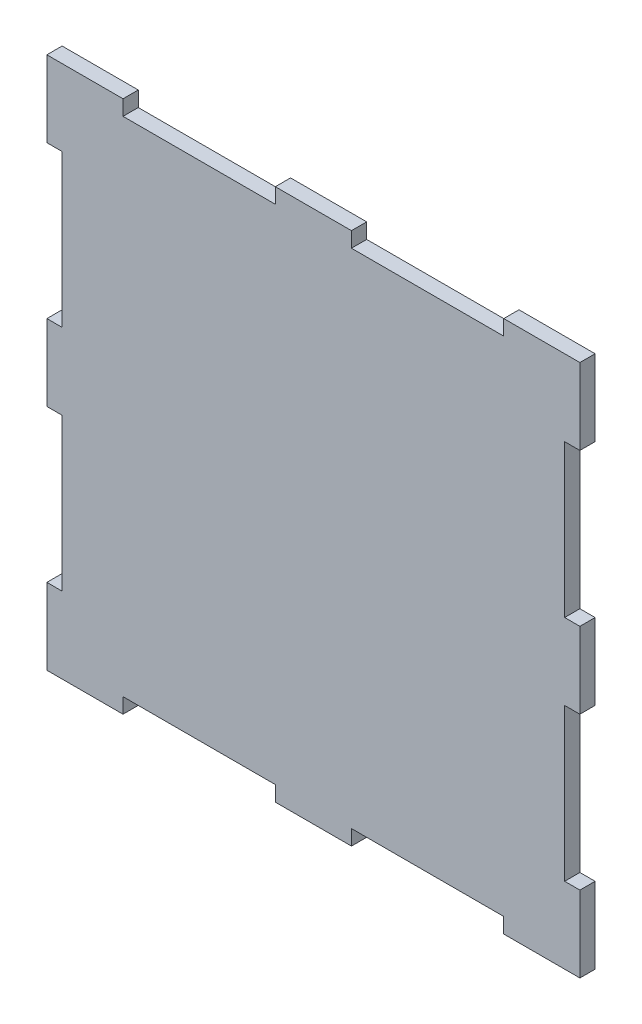
ISO-10303-21;
HEADER;
FILE_DESCRIPTION(('STEP AP214'),'2;1');
FILE_NAME('part.step','',(''),(''),'','','');
FILE_SCHEMA(('AUTOMOTIVE_DESIGN { 1 0 10303 214 1 1 1 1 }'));
ENDSEC;
DATA;
#1=APPLICATION_CONTEXT('core data for automotive mechanical design processes');
#2=APPLICATION_PROTOCOL_DEFINITION('international standard','automotive_design',2000,#1);
#3=PRODUCT_CONTEXT('',#1,'mechanical');
#4=PRODUCT('Part','Part','',(#3));
#5=PRODUCT_RELATED_PRODUCT_CATEGORY('part','',(#4));
#6=PRODUCT_DEFINITION_FORMATION('','',#4);
#7=PRODUCT_DEFINITION_CONTEXT('part definition',#1,'design');
#8=PRODUCT_DEFINITION('design','',#6,#7);
#9=PRODUCT_DEFINITION_SHAPE('','',#8);
#10=(LENGTH_UNIT() NAMED_UNIT(*) SI_UNIT(.MILLI.,.METRE.));
#11=(NAMED_UNIT(*) PLANE_ANGLE_UNIT() SI_UNIT($,.RADIAN.));
#12=(NAMED_UNIT(*) SI_UNIT($,.STERADIAN.) SOLID_ANGLE_UNIT());
#13=UNCERTAINTY_MEASURE_WITH_UNIT(LENGTH_MEASURE(1.E-05),#10,'distance_accuracy_value','');
#14=(GEOMETRIC_REPRESENTATION_CONTEXT(3) GLOBAL_UNCERTAINTY_ASSIGNED_CONTEXT((#13)) GLOBAL_UNIT_ASSIGNED_CONTEXT((#10,
#11,#12)) REPRESENTATION_CONTEXT('',''));
#15=CARTESIAN_POINT('',(0.,0.,0.));
#16=DIRECTION('',(0.,0.,1.));
#17=DIRECTION('',(1.,0.,0.));
#18=AXIS2_PLACEMENT_3D('',#15,#16,#17);
#19=CARTESIAN_POINT('',(35.,-35.,-2.));
#20=DIRECTION('',(1.,0.,0.));
#21=DIRECTION('',(0.,0.,-1.));
#22=AXIS2_PLACEMENT_3D('',#19,#20,#21);
#23=PLANE('',#22);
#24=DIRECTION('',(0.,1.,0.));
#25=VECTOR('',#24,1.);
#26=CARTESIAN_POINT('',(35.,-35.,-2.));
#27=LINE('',#26,#25);
#28=CARTESIAN_POINT('',(35.,-5.,-2.));
#29=VERTEX_POINT('',#28);
#30=CARTESIAN_POINT('',(35.,5.,-2.));
#31=VERTEX_POINT('',#30);
#32=EDGE_CURVE('E485',#29,#31,#27,.T.);
#33=ORIENTED_EDGE('',*,*,#32,.T.);
#34=DIRECTION('',(0.,0.,1.));
#35=VECTOR('',#34,1.);
#36=CARTESIAN_POINT('',(35.,5.,-2.));
#37=LINE('',#36,#35);
#38=CARTESIAN_POINT('',(35.,5.,0.));
#39=VERTEX_POINT('',#38);
#40=EDGE_CURVE('E403',#31,#39,#37,.T.);
#41=ORIENTED_EDGE('',*,*,#40,.T.);
#42=DIRECTION('',(0.,1.,0.));
#43=VECTOR('',#42,1.);
#44=CARTESIAN_POINT('',(35.,-35.,0.));
#45=LINE('',#44,#43);
#46=CARTESIAN_POINT('',(35.,-5.,0.));
#47=VERTEX_POINT('',#46);
#48=EDGE_CURVE('E505',#47,#39,#45,.T.);
#49=ORIENTED_EDGE('',*,*,#48,.F.);
#50=DIRECTION('',(0.,0.,1.));
#51=VECTOR('',#50,1.);
#52=CARTESIAN_POINT('',(35.,-5.,-2.));
#53=LINE('',#52,#51);
#54=EDGE_CURVE('E346',#29,#47,#53,.T.);
#55=ORIENTED_EDGE('',*,*,#54,.F.);
#56=EDGE_LOOP('',(#33,#41,#49,#55));
#57=FACE_BOUND('',#56,.T.);
#58=ADVANCED_FACE('F33',(#57),#23,.T.);
#59=CARTESIAN_POINT('',(35.,-35.,-2.));
#60=VERTEX_POINT('',#59);
#61=CARTESIAN_POINT('',(35.,-25.,-2.));
#62=VERTEX_POINT('',#61);
#63=EDGE_CURVE('E481',#60,#62,#27,.T.);
#64=ORIENTED_EDGE('',*,*,#63,.T.);
#65=DIRECTION('',(0.,0.,1.));
#66=VECTOR('',#65,1.);
#67=CARTESIAN_POINT('',(35.,-25.,-2.));
#68=LINE('',#67,#66);
#69=CARTESIAN_POINT('',(35.,-25.,0.));
#70=VERTEX_POINT('',#69);
#71=EDGE_CURVE('E377',#62,#70,#68,.T.);
#72=ORIENTED_EDGE('',*,*,#71,.T.);
#73=CARTESIAN_POINT('',(35.,-35.,0.));
#74=VERTEX_POINT('',#73);
#75=EDGE_CURVE('E501',#74,#70,#45,.T.);
#76=ORIENTED_EDGE('',*,*,#75,.F.);
#77=DIRECTION('',(0.,0.,1.));
#78=VECTOR('',#77,1.);
#79=CARTESIAN_POINT('',(35.,-35.,-2.));
#80=LINE('',#79,#78);
#81=EDGE_CURVE('E11',#60,#74,#80,.T.);
#82=ORIENTED_EDGE('',*,*,#81,.F.);
#83=EDGE_LOOP('',(#64,#72,#76,#82));
#84=FACE_BOUND('',#83,.T.);
#85=ADVANCED_FACE('F631',(#84),#23,.T.);
#86=CARTESIAN_POINT('',(-35.,-35.,-2.));
#87=DIRECTION('',(0.,-1.,0.));
#88=DIRECTION('',(0.,0.,-1.));
#89=AXIS2_PLACEMENT_3D('',#86,#87,#88);
#90=PLANE('',#89);
#91=DIRECTION('',(1.,0.,0.));
#92=VECTOR('',#91,1.);
#93=CARTESIAN_POINT('',(-35.,-35.,-2.));
#94=LINE('',#93,#92);
#95=CARTESIAN_POINT('',(-5.00000000000001,-35.,-2.));
#96=VERTEX_POINT('',#95);
#97=CARTESIAN_POINT('',(5.,-35.,-2.));
#98=VERTEX_POINT('',#97);
#99=EDGE_CURVE('E500',#96,#98,#94,.T.);
#100=ORIENTED_EDGE('',*,*,#99,.T.);
#101=DIRECTION('',(0.,0.,1.));
#102=VECTOR('',#101,1.);
#103=CARTESIAN_POINT('',(5.,-35.,-2.));
#104=LINE('',#103,#102);
#105=CARTESIAN_POINT('',(5.,-35.,0.));
#106=VERTEX_POINT('',#105);
#107=EDGE_CURVE('E321',#98,#106,#104,.T.);
#108=ORIENTED_EDGE('',*,*,#107,.T.);
#109=DIRECTION('',(1.,0.,0.));
#110=VECTOR('',#109,1.);
#111=CARTESIAN_POINT('',(-35.,-35.,0.));
#112=LINE('',#111,#110);
#113=CARTESIAN_POINT('',(-5.,-35.,0.));
#114=VERTEX_POINT('',#113);
#115=EDGE_CURVE('E518',#114,#106,#112,.T.);
#116=ORIENTED_EDGE('',*,*,#115,.F.);
#117=DIRECTION('',(0.,0.,1.));
#118=VECTOR('',#117,1.);
#119=CARTESIAN_POINT('',(-5.00000000000001,-35.,-2.));
#120=LINE('',#119,#118);
#121=EDGE_CURVE('E316',#96,#114,#120,.T.);
#122=ORIENTED_EDGE('',*,*,#121,.F.);
#123=EDGE_LOOP('',(#100,#108,#116,#122));
#124=FACE_BOUND('',#123,.T.);
#125=ADVANCED_FACE('F635',(#124),#90,.T.);
#126=CARTESIAN_POINT('',(-35.,-35.,-2.));
#127=VERTEX_POINT('',#126);
#128=CARTESIAN_POINT('',(-25.,-35.,-2.));
#129=VERTEX_POINT('',#128);
#130=EDGE_CURVE('E497',#127,#129,#94,.T.);
#131=ORIENTED_EDGE('',*,*,#130,.T.);
#132=DIRECTION('',(0.,0.,1.));
#133=VECTOR('',#132,1.);
#134=CARTESIAN_POINT('',(-25.,-35.,-2.));
#135=LINE('',#134,#133);
#136=CARTESIAN_POINT('',(-25.,-35.,0.));
#137=VERTEX_POINT('',#136);
#138=EDGE_CURVE('E300',#129,#137,#135,.T.);
#139=ORIENTED_EDGE('',*,*,#138,.T.);
#140=CARTESIAN_POINT('',(-35.,-35.,0.));
#141=VERTEX_POINT('',#140);
#142=EDGE_CURVE('E516',#141,#137,#112,.T.);
#143=ORIENTED_EDGE('',*,*,#142,.F.);
#144=DIRECTION('',(0.,0.,1.));
#145=VECTOR('',#144,1.);
#146=CARTESIAN_POINT('',(-35.,-35.,-2.));
#147=LINE('',#146,#145);
#148=EDGE_CURVE('E42',#127,#141,#147,.T.);
#149=ORIENTED_EDGE('',*,*,#148,.F.);
#150=EDGE_LOOP('',(#131,#139,#143,#149));
#151=FACE_BOUND('',#150,.T.);
#152=ADVANCED_FACE('F608',(#151),#90,.T.);
#153=CARTESIAN_POINT('',(-35.,-35.,-2.));
#154=DIRECTION('',(-1.,0.,0.));
#155=DIRECTION('',(0.,0.,1.));
#156=AXIS2_PLACEMENT_3D('',#153,#154,#155);
#157=PLANE('',#156);
#158=DIRECTION('',(0.,-1.,0.));
#159=VECTOR('',#158,1.);
#160=CARTESIAN_POINT('',(-35.,-35.,-2.));
#161=LINE('',#160,#159);
#162=CARTESIAN_POINT('',(-35.,5.,-2.));
#163=VERTEX_POINT('',#162);
#164=CARTESIAN_POINT('',(-35.,-5.,-2.));
#165=VERTEX_POINT('',#164);
#166=EDGE_CURVE('E496',#163,#165,#161,.T.);
#167=ORIENTED_EDGE('',*,*,#166,.T.);
#168=DIRECTION('',(0.,0.,1.));
#169=VECTOR('',#168,1.);
#170=CARTESIAN_POINT('',(-35.,-5.,-2.));
#171=LINE('',#170,#169);
#172=CARTESIAN_POINT('',(-35.,-5.,0.));
#173=VERTEX_POINT('',#172);
#174=EDGE_CURVE('E274',#165,#173,#171,.T.);
#175=ORIENTED_EDGE('',*,*,#174,.T.);
#176=DIRECTION('',(0.,-1.,0.));
#177=VECTOR('',#176,1.);
#178=CARTESIAN_POINT('',(-35.,-35.,0.));
#179=LINE('',#178,#177);
#180=CARTESIAN_POINT('',(-35.,5.,0.));
#181=VERTEX_POINT('',#180);
#182=EDGE_CURVE('E515',#181,#173,#179,.T.);
#183=ORIENTED_EDGE('',*,*,#182,.F.);
#184=DIRECTION('',(0.,0.,1.));
#185=VECTOR('',#184,1.);
#186=CARTESIAN_POINT('',(-35.,5.,-2.));
#187=LINE('',#186,#185);
#188=EDGE_CURVE('E474',#163,#181,#187,.T.);
#189=ORIENTED_EDGE('',*,*,#188,.F.);
#190=EDGE_LOOP('',(#167,#175,#183,#189));
#191=FACE_BOUND('',#190,.T.);
#192=ADVANCED_FACE('F599',(#191),#157,.T.);
#193=CARTESIAN_POINT('',(-35.,35.,-2.));
#194=VERTEX_POINT('',#193);
#195=CARTESIAN_POINT('',(-35.,25.,-2.));
#196=VERTEX_POINT('',#195);
#197=EDGE_CURVE('E492',#194,#196,#161,.T.);
#198=ORIENTED_EDGE('',*,*,#197,.T.);
#199=DIRECTION('',(0.,0.,1.));
#200=VECTOR('',#199,1.);
#201=CARTESIAN_POINT('',(-35.,25.,-2.));
#202=LINE('',#201,#200);
#203=CARTESIAN_POINT('',(-35.,25.,0.));
#204=VERTEX_POINT('',#203);
#205=EDGE_CURVE('E476',#196,#204,#202,.T.);
#206=ORIENTED_EDGE('',*,*,#205,.T.);
#207=CARTESIAN_POINT('',(-35.,35.,0.));
#208=VERTEX_POINT('',#207);
#209=EDGE_CURVE('E511',#208,#204,#179,.T.);
#210=ORIENTED_EDGE('',*,*,#209,.F.);
#211=DIRECTION('',(0.,0.,1.));
#212=VECTOR('',#211,1.);
#213=CARTESIAN_POINT('',(-35.,35.,-2.));
#214=LINE('',#213,#212);
#215=EDGE_CURVE('E521',#194,#208,#214,.T.);
#216=ORIENTED_EDGE('',*,*,#215,.F.);
#217=EDGE_LOOP('',(#198,#206,#210,#216));
#218=FACE_BOUND('',#217,.T.);
#219=ADVANCED_FACE('F585',(#218),#157,.T.);
#220=CARTESIAN_POINT('',(-35.,35.,-2.));
#221=DIRECTION('',(0.,1.,0.));
#222=DIRECTION('',(0.,0.,1.));
#223=AXIS2_PLACEMENT_3D('',#220,#221,#222);
#224=PLANE('',#223);
#225=DIRECTION('',(-1.,0.,0.));
#226=VECTOR('',#225,1.);
#227=CARTESIAN_POINT('',(-35.,35.,0.));
#228=LINE('',#227,#226);
#229=CARTESIAN_POINT('',(-25.,35.,0.));
#230=VERTEX_POINT('',#229);
#231=EDGE_CURVE('E504',#230,#208,#228,.T.);
#232=ORIENTED_EDGE('',*,*,#231,.F.);
#233=DIRECTION('',(0.,0.,1.));
#234=VECTOR('',#233,1.);
#235=CARTESIAN_POINT('',(-25.,35.,-2.));
#236=LINE('',#235,#234);
#237=CARTESIAN_POINT('',(-25.,35.,-2.));
#238=VERTEX_POINT('',#237);
#239=EDGE_CURVE('E449',#238,#230,#236,.T.);
#240=ORIENTED_EDGE('',*,*,#239,.F.);
#241=DIRECTION('',(-1.,0.,0.));
#242=VECTOR('',#241,1.);
#243=CARTESIAN_POINT('',(-35.,35.,-2.));
#244=LINE('',#243,#242);
#245=EDGE_CURVE('E484',#238,#194,#244,.T.);
#246=ORIENTED_EDGE('',*,*,#245,.T.);
#247=ORIENTED_EDGE('',*,*,#215,.T.);
#248=EDGE_LOOP('',(#232,#240,#246,#247));
#249=FACE_BOUND('',#248,.T.);
#250=ADVANCED_FACE('F578',(#249),#224,.T.);
#251=DIRECTION('',(0.,0.,1.));
#252=VECTOR('',#251,1.);
#253=CARTESIAN_POINT('',(-5.,35.,-2.));
#254=LINE('',#253,#252);
#255=CARTESIAN_POINT('',(-5.,35.,-2.));
#256=VERTEX_POINT('',#255);
#257=CARTESIAN_POINT('',(-5.,35.,0.));
#258=VERTEX_POINT('',#257);
#259=EDGE_CURVE('E451',#256,#258,#254,.T.);
#260=ORIENTED_EDGE('',*,*,#259,.T.);
#261=CARTESIAN_POINT('',(5.,35.,0.));
#262=VERTEX_POINT('',#261);
#263=EDGE_CURVE('E510',#262,#258,#228,.T.);
#264=ORIENTED_EDGE('',*,*,#263,.F.);
#265=DIRECTION('',(0.,0.,1.));
#266=VECTOR('',#265,1.);
#267=CARTESIAN_POINT('',(5.,35.,-2.));
#268=LINE('',#267,#266);
#269=CARTESIAN_POINT('',(5.,35.,-2.));
#270=VERTEX_POINT('',#269);
#271=EDGE_CURVE('E427',#270,#262,#268,.T.);
#272=ORIENTED_EDGE('',*,*,#271,.F.);
#273=EDGE_CURVE('E491',#270,#256,#244,.T.);
#274=ORIENTED_EDGE('',*,*,#273,.T.);
#275=EDGE_LOOP('',(#260,#264,#272,#274));
#276=FACE_BOUND('',#275,.T.);
#277=ADVANCED_FACE('F573',(#276),#224,.T.);
#278=CARTESIAN_POINT('',(0.,0.,-2.));
#279=DIRECTION('',(0.,0.,-1.));
#280=DIRECTION('',(-1.,0.,0.));
#281=AXIS2_PLACEMENT_3D('',#278,#279,#280);
#282=PLANE('',#281);
#283=ORIENTED_EDGE('',*,*,#245,.F.);
#284=DIRECTION('',(0.,1.,0.));
#285=VECTOR('',#284,1.);
#286=CARTESIAN_POINT('',(-25.,0.,-2.));
#287=LINE('',#286,#285);
#288=CARTESIAN_POINT('',(-25.,33.,-2.));
#289=VERTEX_POINT('',#288);
#290=EDGE_CURVE('E440',#289,#238,#287,.T.);
#291=ORIENTED_EDGE('',*,*,#290,.F.);
#292=DIRECTION('',(1.,0.,0.));
#293=VECTOR('',#292,1.);
#294=CARTESIAN_POINT('',(0.,33.,-2.));
#295=LINE('',#294,#293);
#296=CARTESIAN_POINT('',(-5.00000000000001,33.,-2.));
#297=VERTEX_POINT('',#296);
#298=EDGE_CURVE('E433',#289,#297,#295,.T.);
#299=ORIENTED_EDGE('',*,*,#298,.T.);
#300=DIRECTION('',(0.,1.,0.));
#301=VECTOR('',#300,1.);
#302=CARTESIAN_POINT('',(-5.00000000000002,0.,-2.));
#303=LINE('',#302,#301);
#304=EDGE_CURVE('E436',#297,#256,#303,.T.);
#305=ORIENTED_EDGE('',*,*,#304,.T.);
#306=ORIENTED_EDGE('',*,*,#273,.F.);
#307=DIRECTION('',(0.,1.,0.));
#308=VECTOR('',#307,1.);
#309=CARTESIAN_POINT('',(5.,0.,-2.));
#310=LINE('',#309,#308);
#311=CARTESIAN_POINT('',(5.,33.,-2.));
#312=VERTEX_POINT('',#311);
#313=EDGE_CURVE('E417',#312,#270,#310,.T.);
#314=ORIENTED_EDGE('',*,*,#313,.F.);
#315=DIRECTION('',(1.,0.,0.));
#316=VECTOR('',#315,1.);
#317=CARTESIAN_POINT('',(0.,33.,-2.));
#318=LINE('',#317,#316);
#319=CARTESIAN_POINT('',(25.,33.,-2.));
#320=VERTEX_POINT('',#319);
#321=EDGE_CURVE('E410',#312,#320,#318,.T.);
#322=ORIENTED_EDGE('',*,*,#321,.T.);
#323=DIRECTION('',(0.,1.,0.));
#324=VECTOR('',#323,1.);
#325=CARTESIAN_POINT('',(25.,0.,-2.));
#326=LINE('',#325,#324);
#327=CARTESIAN_POINT('',(25.,35.,-2.));
#328=VERTEX_POINT('',#327);
#329=EDGE_CURVE('E413',#320,#328,#326,.T.);
#330=ORIENTED_EDGE('',*,*,#329,.T.);
#331=CARTESIAN_POINT('',(35.,35.,-2.));
#332=VERTEX_POINT('',#331);
#333=EDGE_CURVE('E487',#332,#328,#244,.T.);
#334=ORIENTED_EDGE('',*,*,#333,.F.);
#335=CARTESIAN_POINT('',(35.,25.,-2.));
#336=VERTEX_POINT('',#335);
#337=EDGE_CURVE('E486',#336,#332,#27,.T.);
#338=ORIENTED_EDGE('',*,*,#337,.F.);
#339=DIRECTION('',(-1.,0.,0.));
#340=VECTOR('',#339,1.);
#341=CARTESIAN_POINT('',(0.,25.,-2.));
#342=LINE('',#341,#340);
#343=CARTESIAN_POINT('',(33.,25.,-2.));
#344=VERTEX_POINT('',#343);
#345=EDGE_CURVE('E384',#336,#344,#342,.T.);
#346=ORIENTED_EDGE('',*,*,#345,.T.);
#347=DIRECTION('',(0.,-1.,0.));
#348=VECTOR('',#347,1.);
#349=CARTESIAN_POINT('',(33.,0.,-2.));
#350=LINE('',#349,#348);
#351=CARTESIAN_POINT('',(33.,5.,-2.));
#352=VERTEX_POINT('',#351);
#353=EDGE_CURVE('E387',#344,#352,#350,.T.);
#354=ORIENTED_EDGE('',*,*,#353,.T.);
#355=DIRECTION('',(-1.,0.,0.));
#356=VECTOR('',#355,1.);
#357=CARTESIAN_POINT('',(0.,5.,-2.));
#358=LINE('',#357,#356);
#359=EDGE_CURVE('E391',#31,#352,#358,.T.);
#360=ORIENTED_EDGE('',*,*,#359,.F.);
#361=ORIENTED_EDGE('',*,*,#32,.F.);
#362=DIRECTION('',(-1.,0.,0.));
#363=VECTOR('',#362,1.);
#364=CARTESIAN_POINT('',(0.,-5.,-2.));
#365=LINE('',#364,#363);
#366=CARTESIAN_POINT('',(33.,-5.,-2.));
#367=VERTEX_POINT('',#366);
#368=EDGE_CURVE('E358',#29,#367,#365,.T.);
#369=ORIENTED_EDGE('',*,*,#368,.T.);
#370=DIRECTION('',(0.,-1.,0.));
#371=VECTOR('',#370,1.);
#372=CARTESIAN_POINT('',(33.,0.,-2.));
#373=LINE('',#372,#371);
#374=CARTESIAN_POINT('',(33.,-25.,-2.));
#375=VERTEX_POINT('',#374);
#376=EDGE_CURVE('E361',#367,#375,#373,.T.);
#377=ORIENTED_EDGE('',*,*,#376,.T.);
#378=DIRECTION('',(-1.,0.,0.));
#379=VECTOR('',#378,1.);
#380=CARTESIAN_POINT('',(0.,-25.,-2.));
#381=LINE('',#380,#379);
#382=EDGE_CURVE('E365',#62,#375,#381,.T.);
#383=ORIENTED_EDGE('',*,*,#382,.F.);
#384=ORIENTED_EDGE('',*,*,#63,.F.);
#385=CARTESIAN_POINT('',(25.,-35.,-2.));
#386=VERTEX_POINT('',#385);
#387=EDGE_CURVE('E495',#386,#60,#94,.T.);
#388=ORIENTED_EDGE('',*,*,#387,.F.);
#389=DIRECTION('',(0.,1.,0.));
#390=VECTOR('',#389,1.);
#391=CARTESIAN_POINT('',(25.,0.,-2.));
#392=LINE('',#391,#390);
#393=CARTESIAN_POINT('',(25.,-33.,-2.));
#394=VERTEX_POINT('',#393);
#395=EDGE_CURVE('E333',#386,#394,#392,.T.);
#396=ORIENTED_EDGE('',*,*,#395,.T.);
#397=DIRECTION('',(1.,0.,0.));
#398=VECTOR('',#397,1.);
#399=CARTESIAN_POINT('',(0.,-33.,-2.));
#400=LINE('',#399,#398);
#401=CARTESIAN_POINT('',(5.,-33.,-2.));
#402=VERTEX_POINT('',#401);
#403=EDGE_CURVE('E336',#402,#394,#400,.T.);
#404=ORIENTED_EDGE('',*,*,#403,.F.);
#405=DIRECTION('',(0.,1.,0.));
#406=VECTOR('',#405,1.);
#407=CARTESIAN_POINT('',(5.,0.,-2.));
#408=LINE('',#407,#406);
#409=EDGE_CURVE('E339',#98,#402,#408,.T.);
#410=ORIENTED_EDGE('',*,*,#409,.F.);
#411=ORIENTED_EDGE('',*,*,#99,.F.);
#412=DIRECTION('',(0.,1.,0.));
#413=VECTOR('',#412,1.);
#414=CARTESIAN_POINT('',(-5.00000000000001,0.,-2.));
#415=LINE('',#414,#413);
#416=CARTESIAN_POINT('',(-5.00000000000001,-33.,-2.));
#417=VERTEX_POINT('',#416);
#418=EDGE_CURVE('E308',#96,#417,#415,.T.);
#419=ORIENTED_EDGE('',*,*,#418,.T.);
#420=DIRECTION('',(1.,0.,0.));
#421=VECTOR('',#420,1.);
#422=CARTESIAN_POINT('',(0.,-33.,-2.));
#423=LINE('',#422,#421);
#424=CARTESIAN_POINT('',(-25.,-33.,-2.));
#425=VERTEX_POINT('',#424);
#426=EDGE_CURVE('E311',#425,#417,#423,.T.);
#427=ORIENTED_EDGE('',*,*,#426,.F.);
#428=DIRECTION('',(0.,1.,0.));
#429=VECTOR('',#428,1.);
#430=CARTESIAN_POINT('',(-25.,0.,-2.));
#431=LINE('',#430,#429);
#432=EDGE_CURVE('E314',#129,#425,#431,.T.);
#433=ORIENTED_EDGE('',*,*,#432,.F.);
#434=ORIENTED_EDGE('',*,*,#130,.F.);
#435=CARTESIAN_POINT('',(-35.,-25.,-2.));
#436=VERTEX_POINT('',#435);
#437=EDGE_CURVE('E490',#436,#127,#161,.T.);
#438=ORIENTED_EDGE('',*,*,#437,.F.);
#439=DIRECTION('',(1.,0.,0.));
#440=VECTOR('',#439,1.);
#441=CARTESIAN_POINT('',(0.,-25.,-2.));
#442=LINE('',#441,#440);
#443=CARTESIAN_POINT('',(-33.,-25.,-2.));
#444=VERTEX_POINT('',#443);
#445=EDGE_CURVE('E279',#436,#444,#442,.T.);
#446=ORIENTED_EDGE('',*,*,#445,.T.);
#447=DIRECTION('',(0.,-1.,0.));
#448=VECTOR('',#447,1.);
#449=CARTESIAN_POINT('',(-33.,0.,-2.));
#450=LINE('',#449,#448);
#451=CARTESIAN_POINT('',(-33.,-5.,-2.));
#452=VERTEX_POINT('',#451);
#453=EDGE_CURVE('E280',#452,#444,#450,.T.);
#454=ORIENTED_EDGE('',*,*,#453,.F.);
#455=DIRECTION('',(1.,0.,0.));
#456=VECTOR('',#455,1.);
#457=CARTESIAN_POINT('',(0.,-5.,-2.));
#458=LINE('',#457,#456);
#459=EDGE_CURVE('E268',#165,#452,#458,.T.);
#460=ORIENTED_EDGE('',*,*,#459,.F.);
#461=ORIENTED_EDGE('',*,*,#166,.F.);
#462=DIRECTION('',(1.,0.,0.));
#463=VECTOR('',#462,1.);
#464=CARTESIAN_POINT('',(0.,5.,-2.));
#465=LINE('',#464,#463);
#466=CARTESIAN_POINT('',(-33.,5.,-2.));
#467=VERTEX_POINT('',#466);
#468=EDGE_CURVE('E460',#163,#467,#465,.T.);
#469=ORIENTED_EDGE('',*,*,#468,.T.);
#470=DIRECTION('',(0.,-1.,0.));
#471=VECTOR('',#470,1.);
#472=CARTESIAN_POINT('',(-33.,0.,-2.));
#473=LINE('',#472,#471);
#474=CARTESIAN_POINT('',(-33.,25.,-2.));
#475=VERTEX_POINT('',#474);
#476=EDGE_CURVE('E455',#475,#467,#473,.T.);
#477=ORIENTED_EDGE('',*,*,#476,.F.);
#478=DIRECTION('',(1.,0.,0.));
#479=VECTOR('',#478,1.);
#480=CARTESIAN_POINT('',(0.,25.,-2.));
#481=LINE('',#480,#479);
#482=EDGE_CURVE('E457',#196,#475,#481,.T.);
#483=ORIENTED_EDGE('',*,*,#482,.F.);
#484=ORIENTED_EDGE('',*,*,#197,.F.);
#485=EDGE_LOOP('',(#283,#291,#299,#305,#306,#314,#322,#330,#334,#338,#346,#354,#360,#361,#369,
#377,#383,#384,#388,#396,#404,#410,#411,#419,#427,#433,#434,#438,#446,#454,#460,#461,#469,#477,
#483,#484));
#486=FACE_BOUND('',#485,.T.);
#487=ADVANCED_FACE('F290',(#486),#282,.T.);
#488=CARTESIAN_POINT('',(0.,0.,0.));
#489=DIRECTION('',(0.,0.,-1.));
#490=DIRECTION('',(-1.,0.,0.));
#491=AXIS2_PLACEMENT_3D('',#488,#489,#490);
#492=PLANE('',#491);
#493=DIRECTION('',(0.,1.,0.));
#494=VECTOR('',#493,1.);
#495=CARTESIAN_POINT('',(-25.,0.,0.));
#496=LINE('',#495,#494);
#497=CARTESIAN_POINT('',(-25.,33.,0.));
#498=VERTEX_POINT('',#497);
#499=EDGE_CURVE('E437',#498,#230,#496,.T.);
#500=ORIENTED_EDGE('',*,*,#499,.T.);
#501=ORIENTED_EDGE('',*,*,#231,.T.);
#502=ORIENTED_EDGE('',*,*,#209,.T.);
#503=DIRECTION('',(1.,0.,0.));
#504=VECTOR('',#503,1.);
#505=CARTESIAN_POINT('',(0.,25.,0.));
#506=LINE('',#505,#504);
#507=CARTESIAN_POINT('',(-33.,25.,0.));
#508=VERTEX_POINT('',#507);
#509=EDGE_CURVE('E466',#204,#508,#506,.T.);
#510=ORIENTED_EDGE('',*,*,#509,.T.);
#511=DIRECTION('',(0.,-1.,0.));
#512=VECTOR('',#511,1.);
#513=CARTESIAN_POINT('',(-33.,0.,0.));
#514=LINE('',#513,#512);
#515=CARTESIAN_POINT('',(-33.,5.,0.));
#516=VERTEX_POINT('',#515);
#517=EDGE_CURVE('E304',#508,#516,#514,.T.);
#518=ORIENTED_EDGE('',*,*,#517,.T.);
#519=DIRECTION('',(1.,0.,0.));
#520=VECTOR('',#519,1.);
#521=CARTESIAN_POINT('',(0.,5.,0.));
#522=LINE('',#521,#520);
#523=EDGE_CURVE('E458',#181,#516,#522,.T.);
#524=ORIENTED_EDGE('',*,*,#523,.F.);
#525=ORIENTED_EDGE('',*,*,#182,.T.);
#526=DIRECTION('',(1.,0.,0.));
#527=VECTOR('',#526,1.);
#528=CARTESIAN_POINT('',(0.,-5.,0.));
#529=LINE('',#528,#527);
#530=CARTESIAN_POINT('',(-33.,-5.,0.));
#531=VERTEX_POINT('',#530);
#532=EDGE_CURVE('E295',#173,#531,#529,.T.);
#533=ORIENTED_EDGE('',*,*,#532,.T.);
#534=DIRECTION('',(0.,-1.,0.));
#535=VECTOR('',#534,1.);
#536=CARTESIAN_POINT('',(-33.,0.,0.));
#537=LINE('',#536,#535);
#538=CARTESIAN_POINT('',(-33.,-25.,0.));
#539=VERTEX_POINT('',#538);
#540=EDGE_CURVE('E286',#531,#539,#537,.T.);
#541=ORIENTED_EDGE('',*,*,#540,.T.);
#542=DIRECTION('',(1.,0.,0.));
#543=VECTOR('',#542,1.);
#544=CARTESIAN_POINT('',(0.,-25.,0.));
#545=LINE('',#544,#543);
#546=CARTESIAN_POINT('',(-35.,-25.,0.));
#547=VERTEX_POINT('',#546);
#548=EDGE_CURVE('E292',#547,#539,#545,.T.);
#549=ORIENTED_EDGE('',*,*,#548,.F.);
#550=EDGE_CURVE('E509',#547,#141,#179,.T.);
#551=ORIENTED_EDGE('',*,*,#550,.T.);
#552=ORIENTED_EDGE('',*,*,#142,.T.);
#553=DIRECTION('',(0.,1.,0.));
#554=VECTOR('',#553,1.);
#555=CARTESIAN_POINT('',(-25.,0.,0.));
#556=LINE('',#555,#554);
#557=CARTESIAN_POINT('',(-25.,-33.,0.));
#558=VERTEX_POINT('',#557);
#559=EDGE_CURVE('E312',#137,#558,#556,.T.);
#560=ORIENTED_EDGE('',*,*,#559,.T.);
#561=DIRECTION('',(1.,0.,0.));
#562=VECTOR('',#561,1.);
#563=CARTESIAN_POINT('',(0.,-33.,0.));
#564=LINE('',#563,#562);
#565=CARTESIAN_POINT('',(-5.00000000000001,-33.,0.));
#566=VERTEX_POINT('',#565);
#567=EDGE_CURVE('E320',#558,#566,#564,.T.);
#568=ORIENTED_EDGE('',*,*,#567,.T.);
#569=DIRECTION('',(0.,1.,0.));
#570=VECTOR('',#569,1.);
#571=CARTESIAN_POINT('',(-5.00000000000001,0.,0.));
#572=LINE('',#571,#570);
#573=EDGE_CURVE('E317',#114,#566,#572,.T.);
#574=ORIENTED_EDGE('',*,*,#573,.F.);
#575=ORIENTED_EDGE('',*,*,#115,.T.);
#576=DIRECTION('',(0.,1.,0.));
#577=VECTOR('',#576,1.);
#578=CARTESIAN_POINT('',(5.,0.,0.));
#579=LINE('',#578,#577);
#580=CARTESIAN_POINT('',(5.,-33.,0.));
#581=VERTEX_POINT('',#580);
#582=EDGE_CURVE('E337',#106,#581,#579,.T.);
#583=ORIENTED_EDGE('',*,*,#582,.T.);
#584=DIRECTION('',(1.,0.,0.));
#585=VECTOR('',#584,1.);
#586=CARTESIAN_POINT('',(0.,-33.,0.));
#587=LINE('',#586,#585);
#588=CARTESIAN_POINT('',(25.,-33.,0.));
#589=VERTEX_POINT('',#588);
#590=EDGE_CURVE('E345',#581,#589,#587,.T.);
#591=ORIENTED_EDGE('',*,*,#590,.T.);
#592=DIRECTION('',(0.,1.,0.));
#593=VECTOR('',#592,1.);
#594=CARTESIAN_POINT('',(25.,0.,0.));
#595=LINE('',#594,#593);
#596=CARTESIAN_POINT('',(25.,-35.,0.));
#597=VERTEX_POINT('',#596);
#598=EDGE_CURVE('E342',#597,#589,#595,.T.);
#599=ORIENTED_EDGE('',*,*,#598,.F.);
#600=EDGE_CURVE('E514',#597,#74,#112,.T.);
#601=ORIENTED_EDGE('',*,*,#600,.T.);
#602=ORIENTED_EDGE('',*,*,#75,.T.);
#603=DIRECTION('',(-1.,0.,0.));
#604=VECTOR('',#603,1.);
#605=CARTESIAN_POINT('',(0.,-25.,0.));
#606=LINE('',#605,#604);
#607=CARTESIAN_POINT('',(33.,-25.,0.));
#608=VERTEX_POINT('',#607);
#609=EDGE_CURVE('E362',#70,#608,#606,.T.);
#610=ORIENTED_EDGE('',*,*,#609,.T.);
#611=DIRECTION('',(0.,-1.,0.));
#612=VECTOR('',#611,1.);
#613=CARTESIAN_POINT('',(33.,0.,0.));
#614=LINE('',#613,#612);
#615=CARTESIAN_POINT('',(33.,-5.,0.));
#616=VERTEX_POINT('',#615);
#617=EDGE_CURVE('E370',#616,#608,#614,.T.);
#618=ORIENTED_EDGE('',*,*,#617,.F.);
#619=DIRECTION('',(-1.,0.,0.));
#620=VECTOR('',#619,1.);
#621=CARTESIAN_POINT('',(0.,-5.,0.));
#622=LINE('',#621,#620);
#623=EDGE_CURVE('E368',#47,#616,#622,.T.);
#624=ORIENTED_EDGE('',*,*,#623,.F.);
#625=ORIENTED_EDGE('',*,*,#48,.T.);
#626=DIRECTION('',(-1.,0.,0.));
#627=VECTOR('',#626,1.);
#628=CARTESIAN_POINT('',(0.,5.,0.));
#629=LINE('',#628,#627);
#630=CARTESIAN_POINT('',(33.,5.,0.));
#631=VERTEX_POINT('',#630);
#632=EDGE_CURVE('E388',#39,#631,#629,.T.);
#633=ORIENTED_EDGE('',*,*,#632,.T.);
#634=DIRECTION('',(0.,-1.,0.));
#635=VECTOR('',#634,1.);
#636=CARTESIAN_POINT('',(33.,0.,0.));
#637=LINE('',#636,#635);
#638=CARTESIAN_POINT('',(33.,25.,0.));
#639=VERTEX_POINT('',#638);
#640=EDGE_CURVE('E396',#639,#631,#637,.T.);
#641=ORIENTED_EDGE('',*,*,#640,.F.);
#642=DIRECTION('',(-1.,0.,0.));
#643=VECTOR('',#642,1.);
#644=CARTESIAN_POINT('',(0.,25.,0.));
#645=LINE('',#644,#643);
#646=CARTESIAN_POINT('',(35.,25.,0.));
#647=VERTEX_POINT('',#646);
#648=EDGE_CURVE('E394',#647,#639,#645,.T.);
#649=ORIENTED_EDGE('',*,*,#648,.F.);
#650=CARTESIAN_POINT('',(35.,35.,0.));
#651=VERTEX_POINT('',#650);
#652=EDGE_CURVE('E473',#647,#651,#45,.T.);
#653=ORIENTED_EDGE('',*,*,#652,.T.);
#654=CARTESIAN_POINT('',(25.,35.,0.));
#655=VERTEX_POINT('',#654);
#656=EDGE_CURVE('E506',#651,#655,#228,.T.);
#657=ORIENTED_EDGE('',*,*,#656,.T.);
#658=DIRECTION('',(0.,1.,0.));
#659=VECTOR('',#658,1.);
#660=CARTESIAN_POINT('',(25.,0.,0.));
#661=LINE('',#660,#659);
#662=CARTESIAN_POINT('',(25.,33.,0.));
#663=VERTEX_POINT('',#662);
#664=EDGE_CURVE('E421',#663,#655,#661,.T.);
#665=ORIENTED_EDGE('',*,*,#664,.F.);
#666=DIRECTION('',(1.,0.,0.));
#667=VECTOR('',#666,1.);
#668=CARTESIAN_POINT('',(0.,33.,0.));
#669=LINE('',#668,#667);
#670=CARTESIAN_POINT('',(5.,33.,0.));
#671=VERTEX_POINT('',#670);
#672=EDGE_CURVE('E58',#671,#663,#669,.T.);
#673=ORIENTED_EDGE('',*,*,#672,.F.);
#674=DIRECTION('',(0.,1.,0.));
#675=VECTOR('',#674,1.);
#676=CARTESIAN_POINT('',(5.,0.,0.));
#677=LINE('',#676,#675);
#678=EDGE_CURVE('E414',#671,#262,#677,.T.);
#679=ORIENTED_EDGE('',*,*,#678,.T.);
#680=ORIENTED_EDGE('',*,*,#263,.T.);
#681=DIRECTION('',(0.,1.,0.));
#682=VECTOR('',#681,1.);
#683=CARTESIAN_POINT('',(-5.00000000000002,0.,0.));
#684=LINE('',#683,#682);
#685=CARTESIAN_POINT('',(-5.00000000000001,33.,0.));
#686=VERTEX_POINT('',#685);
#687=EDGE_CURVE('E444',#686,#258,#684,.T.);
#688=ORIENTED_EDGE('',*,*,#687,.F.);
#689=DIRECTION('',(1.,0.,0.));
#690=VECTOR('',#689,1.);
#691=CARTESIAN_POINT('',(0.,33.,0.));
#692=LINE('',#691,#690);
#693=EDGE_CURVE('E50',#498,#686,#692,.T.);
#694=ORIENTED_EDGE('',*,*,#693,.F.);
#695=EDGE_LOOP('',(#500,#501,#502,#510,#518,#524,#525,#533,#541,#549,#551,#552,#560,#568,#574,
#575,#583,#591,#599,#601,#602,#610,#618,#624,#625,#633,#641,#649,#653,#657,#665,#673,#679,#680,
#688,#694));
#696=FACE_BOUND('',#695,.T.);
#697=ADVANCED_FACE('F539',(#696),#492,.F.);
#698=DIRECTION('',(0.,0.,1.));
#699=VECTOR('',#698,1.);
#700=CARTESIAN_POINT('',(35.,25.,-2.));
#701=LINE('',#700,#699);
#702=EDGE_CURVE('E371',#336,#647,#701,.T.);
#703=ORIENTED_EDGE('',*,*,#702,.F.);
#704=ORIENTED_EDGE('',*,*,#337,.T.);
#705=DIRECTION('',(0.,0.,1.));
#706=VECTOR('',#705,1.);
#707=CARTESIAN_POINT('',(35.,35.,-2.));
#708=LINE('',#707,#706);
#709=EDGE_CURVE('E37',#332,#651,#708,.T.);
#710=ORIENTED_EDGE('',*,*,#709,.T.);
#711=ORIENTED_EDGE('',*,*,#652,.F.);
#712=EDGE_LOOP('',(#703,#704,#710,#711));
#713=FACE_BOUND('',#712,.T.);
#714=ADVANCED_FACE('F35',(#713),#23,.T.);
#715=DIRECTION('',(0.,0.,1.));
#716=VECTOR('',#715,1.);
#717=CARTESIAN_POINT('',(25.,-35.,-2.));
#718=LINE('',#717,#716);
#719=EDGE_CURVE('E341',#386,#597,#718,.T.);
#720=ORIENTED_EDGE('',*,*,#719,.F.);
#721=ORIENTED_EDGE('',*,*,#387,.T.);
#722=ORIENTED_EDGE('',*,*,#81,.T.);
#723=ORIENTED_EDGE('',*,*,#600,.F.);
#724=EDGE_LOOP('',(#720,#721,#722,#723));
#725=FACE_BOUND('',#724,.T.);
#726=ADVANCED_FACE('F638',(#725),#90,.T.);
#727=DIRECTION('',(0.,0.,1.));
#728=VECTOR('',#727,1.);
#729=CARTESIAN_POINT('',(-35.,-25.,-2.));
#730=LINE('',#729,#728);
#731=EDGE_CURVE('E305',#436,#547,#730,.T.);
#732=ORIENTED_EDGE('',*,*,#731,.F.);
#733=ORIENTED_EDGE('',*,*,#437,.T.);
#734=ORIENTED_EDGE('',*,*,#148,.T.);
#735=ORIENTED_EDGE('',*,*,#550,.F.);
#736=EDGE_LOOP('',(#732,#733,#734,#735));
#737=FACE_BOUND('',#736,.T.);
#738=ADVANCED_FACE('F603',(#737),#157,.T.);
#739=DIRECTION('',(0.,0.,1.));
#740=VECTOR('',#739,1.);
#741=CARTESIAN_POINT('',(25.,35.,-2.));
#742=LINE('',#741,#740);
#743=EDGE_CURVE('E429',#328,#655,#742,.T.);
#744=ORIENTED_EDGE('',*,*,#743,.T.);
#745=ORIENTED_EDGE('',*,*,#656,.F.);
#746=ORIENTED_EDGE('',*,*,#709,.F.);
#747=ORIENTED_EDGE('',*,*,#333,.T.);
#748=EDGE_LOOP('',(#744,#745,#746,#747));
#749=FACE_BOUND('',#748,.T.);
#750=ADVANCED_FACE('F536',(#749),#224,.T.);
#751=CARTESIAN_POINT('',(-33.,0.,-2.));
#752=DIRECTION('',(-1.,0.,0.));
#753=DIRECTION('',(0.,0.,1.));
#754=AXIS2_PLACEMENT_3D('',#751,#752,#753);
#755=PLANE('',#754);
#756=ORIENTED_EDGE('',*,*,#517,.F.);
#757=DIRECTION('',(0.,0.,1.));
#758=VECTOR('',#757,1.);
#759=CARTESIAN_POINT('',(-33.,25.,-2.));
#760=LINE('',#759,#758);
#761=EDGE_CURVE('E463',#475,#508,#760,.T.);
#762=ORIENTED_EDGE('',*,*,#761,.F.);
#763=ORIENTED_EDGE('',*,*,#476,.T.);
#764=DIRECTION('',(0.,0.,1.));
#765=VECTOR('',#764,1.);
#766=CARTESIAN_POINT('',(-33.,5.,-2.));
#767=LINE('',#766,#765);
#768=EDGE_CURVE('E471',#467,#516,#767,.T.);
#769=ORIENTED_EDGE('',*,*,#768,.T.);
#770=EDGE_LOOP('',(#756,#762,#763,#769));
#771=FACE_BOUND('',#770,.T.);
#772=ADVANCED_FACE('F593',(#771),#755,.T.);
#773=CARTESIAN_POINT('',(0.,5.,-2.));
#774=DIRECTION('',(0.,-1.,0.));
#775=DIRECTION('',(0.,0.,-1.));
#776=AXIS2_PLACEMENT_3D('',#773,#774,#775);
#777=PLANE('',#776);
#778=ORIENTED_EDGE('',*,*,#523,.T.);
#779=ORIENTED_EDGE('',*,*,#768,.F.);
#780=ORIENTED_EDGE('',*,*,#468,.F.);
#781=ORIENTED_EDGE('',*,*,#188,.T.);
#782=EDGE_LOOP('',(#778,#779,#780,#781));
#783=FACE_BOUND('',#782,.T.);
#784=ADVANCED_FACE('F596',(#783),#777,.F.);
#785=CARTESIAN_POINT('',(0.,25.,-2.));
#786=DIRECTION('',(0.,-1.,0.));
#787=DIRECTION('',(0.,0.,-1.));
#788=AXIS2_PLACEMENT_3D('',#785,#786,#787);
#789=PLANE('',#788);
#790=ORIENTED_EDGE('',*,*,#509,.F.);
#791=ORIENTED_EDGE('',*,*,#205,.F.);
#792=ORIENTED_EDGE('',*,*,#482,.T.);
#793=ORIENTED_EDGE('',*,*,#761,.T.);
#794=EDGE_LOOP('',(#790,#791,#792,#793));
#795=FACE_BOUND('',#794,.T.);
#796=ADVANCED_FACE('F587',(#795),#789,.T.);
#797=CARTESIAN_POINT('',(-33.,0.,-2.));
#798=DIRECTION('',(-1.,0.,0.));
#799=DIRECTION('',(0.,0.,1.));
#800=AXIS2_PLACEMENT_3D('',#797,#798,#799);
#801=PLANE('',#800);
#802=ORIENTED_EDGE('',*,*,#540,.F.);
#803=DIRECTION('',(0.,0.,1.));
#804=VECTOR('',#803,1.);
#805=CARTESIAN_POINT('',(-33.,-5.,-2.));
#806=LINE('',#805,#804);
#807=EDGE_CURVE('E271',#452,#531,#806,.T.);
#808=ORIENTED_EDGE('',*,*,#807,.F.);
#809=ORIENTED_EDGE('',*,*,#453,.T.);
#810=DIRECTION('',(0.,0.,1.));
#811=VECTOR('',#810,1.);
#812=CARTESIAN_POINT('',(-33.,-25.,-2.));
#813=LINE('',#812,#811);
#814=EDGE_CURVE('E302',#444,#539,#813,.T.);
#815=ORIENTED_EDGE('',*,*,#814,.T.);
#816=EDGE_LOOP('',(#802,#808,#809,#815));
#817=FACE_BOUND('',#816,.T.);
#818=ADVANCED_FACE('F283',(#817),#801,.T.);
#819=CARTESIAN_POINT('',(0.,-25.,-2.));
#820=DIRECTION('',(0.,-1.,0.));
#821=DIRECTION('',(0.,0.,-1.));
#822=AXIS2_PLACEMENT_3D('',#819,#820,#821);
#823=PLANE('',#822);
#824=ORIENTED_EDGE('',*,*,#548,.T.);
#825=ORIENTED_EDGE('',*,*,#814,.F.);
#826=ORIENTED_EDGE('',*,*,#445,.F.);
#827=ORIENTED_EDGE('',*,*,#731,.T.);
#828=EDGE_LOOP('',(#824,#825,#826,#827));
#829=FACE_BOUND('',#828,.T.);
#830=ADVANCED_FACE('F621',(#829),#823,.F.);
#831=CARTESIAN_POINT('',(0.,-5.,-2.));
#832=DIRECTION('',(0.,-1.,0.));
#833=DIRECTION('',(0.,0.,-1.));
#834=AXIS2_PLACEMENT_3D('',#831,#832,#833);
#835=PLANE('',#834);
#836=ORIENTED_EDGE('',*,*,#532,.F.);
#837=ORIENTED_EDGE('',*,*,#174,.F.);
#838=ORIENTED_EDGE('',*,*,#459,.T.);
#839=ORIENTED_EDGE('',*,*,#807,.T.);
#840=EDGE_LOOP('',(#836,#837,#838,#839));
#841=FACE_BOUND('',#840,.T.);
#842=ADVANCED_FACE('F270',(#841),#835,.T.);
#843=CARTESIAN_POINT('',(-25.,0.,-2.));
#844=DIRECTION('',(1.,0.,0.));
#845=DIRECTION('',(0.,0.,-1.));
#846=AXIS2_PLACEMENT_3D('',#843,#844,#845);
#847=PLANE('',#846);
#848=ORIENTED_EDGE('',*,*,#559,.F.);
#849=ORIENTED_EDGE('',*,*,#138,.F.);
#850=ORIENTED_EDGE('',*,*,#432,.T.);
#851=DIRECTION('',(0.,0.,1.));
#852=VECTOR('',#851,1.);
#853=CARTESIAN_POINT('',(-25.,-33.,-2.));
#854=LINE('',#853,#852);
#855=EDGE_CURVE('E328',#425,#558,#854,.T.);
#856=ORIENTED_EDGE('',*,*,#855,.T.);
#857=EDGE_LOOP('',(#848,#849,#850,#856));
#858=FACE_BOUND('',#857,.T.);
#859=ADVANCED_FACE('F613',(#858),#847,.T.);
#860=CARTESIAN_POINT('',(0.,-33.,-2.));
#861=DIRECTION('',(0.,-1.,0.));
#862=DIRECTION('',(0.,0.,-1.));
#863=AXIS2_PLACEMENT_3D('',#860,#861,#862);
#864=PLANE('',#863);
#865=ORIENTED_EDGE('',*,*,#567,.F.);
#866=ORIENTED_EDGE('',*,*,#855,.F.);
#867=ORIENTED_EDGE('',*,*,#426,.T.);
#868=DIRECTION('',(0.,0.,1.));
#869=VECTOR('',#868,1.);
#870=CARTESIAN_POINT('',(-5.00000000000001,-33.,-2.));
#871=LINE('',#870,#869);
#872=EDGE_CURVE('E330',#417,#566,#871,.T.);
#873=ORIENTED_EDGE('',*,*,#872,.T.);
#874=EDGE_LOOP('',(#865,#866,#867,#873));
#875=FACE_BOUND('',#874,.T.);
#876=ADVANCED_FACE('F616',(#875),#864,.T.);
#877=CARTESIAN_POINT('',(-5.00000000000001,0.,-2.));
#878=DIRECTION('',(1.,0.,0.));
#879=DIRECTION('',(0.,0.,-1.));
#880=AXIS2_PLACEMENT_3D('',#877,#878,#879);
#881=PLANE('',#880);
#882=ORIENTED_EDGE('',*,*,#573,.T.);
#883=ORIENTED_EDGE('',*,*,#872,.F.);
#884=ORIENTED_EDGE('',*,*,#418,.F.);
#885=ORIENTED_EDGE('',*,*,#121,.T.);
#886=EDGE_LOOP('',(#882,#883,#884,#885));
#887=FACE_BOUND('',#886,.T.);
#888=ADVANCED_FACE('F748',(#887),#881,.F.);
#889=CARTESIAN_POINT('',(5.,0.,-2.));
#890=DIRECTION('',(1.,0.,0.));
#891=DIRECTION('',(0.,0.,-1.));
#892=AXIS2_PLACEMENT_3D('',#889,#890,#891);
#893=PLANE('',#892);
#894=ORIENTED_EDGE('',*,*,#582,.F.);
#895=ORIENTED_EDGE('',*,*,#107,.F.);
#896=ORIENTED_EDGE('',*,*,#409,.T.);
#897=DIRECTION('',(0.,0.,1.));
#898=VECTOR('',#897,1.);
#899=CARTESIAN_POINT('',(5.,-33.,-2.));
#900=LINE('',#899,#898);
#901=EDGE_CURVE('E353',#402,#581,#900,.T.);
#902=ORIENTED_EDGE('',*,*,#901,.T.);
#903=EDGE_LOOP('',(#894,#895,#896,#902));
#904=FACE_BOUND('',#903,.T.);
#905=ADVANCED_FACE('F757',(#904),#893,.T.);
#906=CARTESIAN_POINT('',(0.,-33.,-2.));
#907=DIRECTION('',(0.,-1.,0.));
#908=DIRECTION('',(0.,0.,-1.));
#909=AXIS2_PLACEMENT_3D('',#906,#907,#908);
#910=PLANE('',#909);
#911=ORIENTED_EDGE('',*,*,#590,.F.);
#912=ORIENTED_EDGE('',*,*,#901,.F.);
#913=ORIENTED_EDGE('',*,*,#403,.T.);
#914=DIRECTION('',(0.,0.,1.));
#915=VECTOR('',#914,1.);
#916=CARTESIAN_POINT('',(25.,-33.,-2.));
#917=LINE('',#916,#915);
#918=EDGE_CURVE('E355',#394,#589,#917,.T.);
#919=ORIENTED_EDGE('',*,*,#918,.T.);
#920=EDGE_LOOP('',(#911,#912,#913,#919));
#921=FACE_BOUND('',#920,.T.);
#922=ADVANCED_FACE('F767',(#921),#910,.T.);
#923=CARTESIAN_POINT('',(25.,0.,-2.));
#924=DIRECTION('',(1.,0.,0.));
#925=DIRECTION('',(0.,0.,-1.));
#926=AXIS2_PLACEMENT_3D('',#923,#924,#925);
#927=PLANE('',#926);
#928=ORIENTED_EDGE('',*,*,#598,.T.);
#929=ORIENTED_EDGE('',*,*,#918,.F.);
#930=ORIENTED_EDGE('',*,*,#395,.F.);
#931=ORIENTED_EDGE('',*,*,#719,.T.);
#932=EDGE_LOOP('',(#928,#929,#930,#931));
#933=FACE_BOUND('',#932,.T.);
#934=ADVANCED_FACE('F777',(#933),#927,.F.);
#935=CARTESIAN_POINT('',(0.,-5.,-2.));
#936=DIRECTION('',(0.,1.,0.));
#937=DIRECTION('',(0.,0.,1.));
#938=AXIS2_PLACEMENT_3D('',#935,#936,#937);
#939=PLANE('',#938);
#940=ORIENTED_EDGE('',*,*,#623,.T.);
#941=DIRECTION('',(0.,0.,1.));
#942=VECTOR('',#941,1.);
#943=CARTESIAN_POINT('',(33.,-5.,-2.));
#944=LINE('',#943,#942);
#945=EDGE_CURVE('E367',#367,#616,#944,.T.);
#946=ORIENTED_EDGE('',*,*,#945,.F.);
#947=ORIENTED_EDGE('',*,*,#368,.F.);
#948=ORIENTED_EDGE('',*,*,#54,.T.);
#949=EDGE_LOOP('',(#940,#946,#947,#948));
#950=FACE_BOUND('',#949,.T.);
#951=ADVANCED_FACE('F787',(#950),#939,.F.);
#952=CARTESIAN_POINT('',(0.,-25.,-2.));
#953=DIRECTION('',(0.,1.,0.));
#954=DIRECTION('',(0.,0.,1.));
#955=AXIS2_PLACEMENT_3D('',#952,#953,#954);
#956=PLANE('',#955);
#957=ORIENTED_EDGE('',*,*,#609,.F.);
#958=ORIENTED_EDGE('',*,*,#71,.F.);
#959=ORIENTED_EDGE('',*,*,#382,.T.);
#960=DIRECTION('',(0.,0.,1.));
#961=VECTOR('',#960,1.);
#962=CARTESIAN_POINT('',(33.,-25.,-2.));
#963=LINE('',#962,#961);
#964=EDGE_CURVE('E380',#375,#608,#963,.T.);
#965=ORIENTED_EDGE('',*,*,#964,.T.);
#966=EDGE_LOOP('',(#957,#958,#959,#965));
#967=FACE_BOUND('',#966,.T.);
#968=ADVANCED_FACE('F797',(#967),#956,.T.);
#969=CARTESIAN_POINT('',(33.,0.,-2.));
#970=DIRECTION('',(-1.,0.,0.));
#971=DIRECTION('',(0.,0.,1.));
#972=AXIS2_PLACEMENT_3D('',#969,#970,#971);
#973=PLANE('',#972);
#974=ORIENTED_EDGE('',*,*,#617,.T.);
#975=ORIENTED_EDGE('',*,*,#964,.F.);
#976=ORIENTED_EDGE('',*,*,#376,.F.);
#977=ORIENTED_EDGE('',*,*,#945,.T.);
#978=EDGE_LOOP('',(#974,#975,#976,#977));
#979=FACE_BOUND('',#978,.T.);
#980=ADVANCED_FACE('F807',(#979),#973,.F.);
#981=CARTESIAN_POINT('',(0.,25.,-2.));
#982=DIRECTION('',(0.,1.,0.));
#983=DIRECTION('',(0.,0.,1.));
#984=AXIS2_PLACEMENT_3D('',#981,#982,#983);
#985=PLANE('',#984);
#986=ORIENTED_EDGE('',*,*,#648,.T.);
#987=DIRECTION('',(0.,0.,1.));
#988=VECTOR('',#987,1.);
#989=CARTESIAN_POINT('',(33.,25.,-2.));
#990=LINE('',#989,#988);
#991=EDGE_CURVE('E393',#344,#639,#990,.T.);
#992=ORIENTED_EDGE('',*,*,#991,.F.);
#993=ORIENTED_EDGE('',*,*,#345,.F.);
#994=ORIENTED_EDGE('',*,*,#702,.T.);
#995=EDGE_LOOP('',(#986,#992,#993,#994));
#996=FACE_BOUND('',#995,.T.);
#997=ADVANCED_FACE('F558',(#996),#985,.F.);
#998=CARTESIAN_POINT('',(0.,5.,-2.));
#999=DIRECTION('',(0.,1.,0.));
#1000=DIRECTION('',(0.,0.,1.));
#1001=AXIS2_PLACEMENT_3D('',#998,#999,#1000);
#1002=PLANE('',#1001);
#1003=ORIENTED_EDGE('',*,*,#632,.F.);
#1004=ORIENTED_EDGE('',*,*,#40,.F.);
#1005=ORIENTED_EDGE('',*,*,#359,.T.);
#1006=DIRECTION('',(0.,0.,1.));
#1007=VECTOR('',#1006,1.);
#1008=CARTESIAN_POINT('',(33.,5.,-2.));
#1009=LINE('',#1008,#1007);
#1010=EDGE_CURVE('E406',#352,#631,#1009,.T.);
#1011=ORIENTED_EDGE('',*,*,#1010,.T.);
#1012=EDGE_LOOP('',(#1003,#1004,#1005,#1011));
#1013=FACE_BOUND('',#1012,.T.);
#1014=ADVANCED_FACE('F552',(#1013),#1002,.T.);
#1015=CARTESIAN_POINT('',(33.,0.,-2.));
#1016=DIRECTION('',(-1.,0.,0.));
#1017=DIRECTION('',(0.,0.,1.));
#1018=AXIS2_PLACEMENT_3D('',#1015,#1016,#1017);
#1019=PLANE('',#1018);
#1020=ORIENTED_EDGE('',*,*,#640,.T.);
#1021=ORIENTED_EDGE('',*,*,#1010,.F.);
#1022=ORIENTED_EDGE('',*,*,#353,.F.);
#1023=ORIENTED_EDGE('',*,*,#991,.T.);
#1024=EDGE_LOOP('',(#1020,#1021,#1022,#1023));
#1025=FACE_BOUND('',#1024,.T.);
#1026=ADVANCED_FACE('F556',(#1025),#1019,.F.);
#1027=CARTESIAN_POINT('',(0.,33.,-2.));
#1028=DIRECTION('',(0.,-1.,0.));
#1029=DIRECTION('',(1.,0.,0.));
#1030=AXIS2_PLACEMENT_3D('',#1027,#1028,#1029);
#1031=PLANE('',#1030);
#1032=ORIENTED_EDGE('',*,*,#672,.T.);
#1033=DIRECTION('',(0.,0.,1.));
#1034=VECTOR('',#1033,1.);
#1035=CARTESIAN_POINT('',(25.,33.,-2.));
#1036=LINE('',#1035,#1034);
#1037=EDGE_CURVE('E419',#320,#663,#1036,.T.);
#1038=ORIENTED_EDGE('',*,*,#1037,.F.);
#1039=ORIENTED_EDGE('',*,*,#321,.F.);
#1040=DIRECTION('',(0.,0.,1.));
#1041=VECTOR('',#1040,1.);
#1042=CARTESIAN_POINT('',(5.,33.,-2.));
#1043=LINE('',#1042,#1041);
#1044=EDGE_CURVE('E397',#312,#671,#1043,.T.);
#1045=ORIENTED_EDGE('',*,*,#1044,.T.);
#1046=EDGE_LOOP('',(#1032,#1038,#1039,#1045));
#1047=FACE_BOUND('',#1046,.T.);
#1048=ADVANCED_FACE('F564',(#1047),#1031,.F.);
#1049=CARTESIAN_POINT('',(5.,0.,-2.));
#1050=DIRECTION('',(1.,0.,0.));
#1051=DIRECTION('',(0.,0.,-1.));
#1052=AXIS2_PLACEMENT_3D('',#1049,#1050,#1051);
#1053=PLANE('',#1052);
#1054=ORIENTED_EDGE('',*,*,#678,.F.);
#1055=ORIENTED_EDGE('',*,*,#1044,.F.);
#1056=ORIENTED_EDGE('',*,*,#313,.T.);
#1057=ORIENTED_EDGE('',*,*,#271,.T.);
#1058=EDGE_LOOP('',(#1054,#1055,#1056,#1057));
#1059=FACE_BOUND('',#1058,.T.);
#1060=ADVANCED_FACE('F570',(#1059),#1053,.T.);
#1061=CARTESIAN_POINT('',(25.,0.,-2.));
#1062=DIRECTION('',(1.,0.,0.));
#1063=DIRECTION('',(0.,0.,-1.));
#1064=AXIS2_PLACEMENT_3D('',#1061,#1062,#1063);
#1065=PLANE('',#1064);
#1066=ORIENTED_EDGE('',*,*,#664,.T.);
#1067=ORIENTED_EDGE('',*,*,#743,.F.);
#1068=ORIENTED_EDGE('',*,*,#329,.F.);
#1069=ORIENTED_EDGE('',*,*,#1037,.T.);
#1070=EDGE_LOOP('',(#1066,#1067,#1068,#1069));
#1071=FACE_BOUND('',#1070,.T.);
#1072=ADVANCED_FACE('F563',(#1071),#1065,.F.);
#1073=CARTESIAN_POINT('',(0.,33.,-2.));
#1074=DIRECTION('',(0.,-1.,0.));
#1075=DIRECTION('',(1.,0.,0.));
#1076=AXIS2_PLACEMENT_3D('',#1073,#1074,#1075);
#1077=PLANE('',#1076);
#1078=ORIENTED_EDGE('',*,*,#693,.T.);
#1079=DIRECTION('',(0.,0.,1.));
#1080=VECTOR('',#1079,1.);
#1081=CARTESIAN_POINT('',(-5.00000000000001,33.,-2.));
#1082=LINE('',#1081,#1080);
#1083=EDGE_CURVE('E442',#297,#686,#1082,.T.);
#1084=ORIENTED_EDGE('',*,*,#1083,.F.);
#1085=ORIENTED_EDGE('',*,*,#298,.F.);
#1086=DIRECTION('',(0.,0.,1.));
#1087=VECTOR('',#1086,1.);
#1088=CARTESIAN_POINT('',(-25.,33.,-2.));
#1089=LINE('',#1088,#1087);
#1090=EDGE_CURVE('E422',#289,#498,#1089,.T.);
#1091=ORIENTED_EDGE('',*,*,#1090,.T.);
#1092=EDGE_LOOP('',(#1078,#1084,#1085,#1091));
#1093=FACE_BOUND('',#1092,.T.);
#1094=ADVANCED_FACE('F866',(#1093),#1077,.F.);
#1095=CARTESIAN_POINT('',(-25.,0.,-2.));
#1096=DIRECTION('',(1.,0.,0.));
#1097=DIRECTION('',(0.,1.,0.));
#1098=AXIS2_PLACEMENT_3D('',#1095,#1096,#1097);
#1099=PLANE('',#1098);
#1100=ORIENTED_EDGE('',*,*,#499,.F.);
#1101=ORIENTED_EDGE('',*,*,#1090,.F.);
#1102=ORIENTED_EDGE('',*,*,#290,.T.);
#1103=ORIENTED_EDGE('',*,*,#239,.T.);
#1104=EDGE_LOOP('',(#1100,#1101,#1102,#1103));
#1105=FACE_BOUND('',#1104,.T.);
#1106=ADVANCED_FACE('F875',(#1105),#1099,.T.);
#1107=CARTESIAN_POINT('',(-5.00000000000002,0.,-2.));
#1108=DIRECTION('',(1.,0.,0.));
#1109=DIRECTION('',(0.,1.,0.));
#1110=AXIS2_PLACEMENT_3D('',#1107,#1108,#1109);
#1111=PLANE('',#1110);
#1112=ORIENTED_EDGE('',*,*,#687,.T.);
#1113=ORIENTED_EDGE('',*,*,#259,.F.);
#1114=ORIENTED_EDGE('',*,*,#304,.F.);
#1115=ORIENTED_EDGE('',*,*,#1083,.T.);
#1116=EDGE_LOOP('',(#1112,#1113,#1114,#1115));
#1117=FACE_BOUND('',#1116,.T.);
#1118=ADVANCED_FACE('F884',(#1117),#1111,.F.);
#1119=CLOSED_SHELL('',(#58,#85,#125,#152,#192,#219,#250,#277,#487,#697,#714,#726,#738,#750,#772,
#784,#796,#818,#830,#842,#859,#876,#888,#905,#922,#934,#951,#968,#980,#997,#1014,#1026,#1048,
#1060,#1072,#1094,#1106,#1118));
#1120=MANIFOLD_SOLID_BREP('B2',#1119);
#1121=ADVANCED_BREP_SHAPE_REPRESENTATION('',(#18,#1120),#14);
#1122=SHAPE_DEFINITION_REPRESENTATION(#9,#1121);
ENDSEC;
END-ISO-10303-21;
